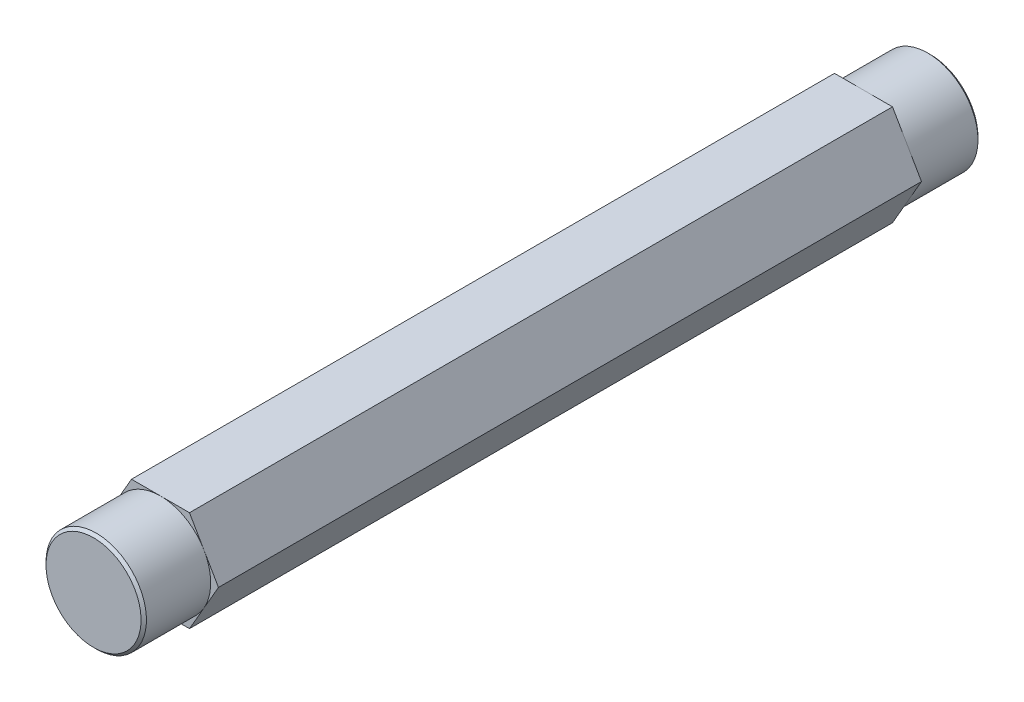
ISO-10303-21;
HEADER;
FILE_DESCRIPTION(('STEP AP214'),'2;1');
FILE_NAME('part.step','',(''),(''),'','','');
FILE_SCHEMA(('AUTOMOTIVE_DESIGN { 1 0 10303 214 1 1 1 1 }'));
ENDSEC;
DATA;
#1=APPLICATION_CONTEXT('core data for automotive mechanical design processes');
#2=APPLICATION_PROTOCOL_DEFINITION('international standard','automotive_design',2000,#1);
#3=PRODUCT_CONTEXT('',#1,'mechanical');
#4=PRODUCT('Part','Part','',(#3));
#5=PRODUCT_RELATED_PRODUCT_CATEGORY('part','',(#4));
#6=PRODUCT_DEFINITION_FORMATION('','',#4);
#7=PRODUCT_DEFINITION_CONTEXT('part definition',#1,'design');
#8=PRODUCT_DEFINITION('design','',#6,#7);
#9=PRODUCT_DEFINITION_SHAPE('','',#8);
#10=(LENGTH_UNIT() NAMED_UNIT(*) SI_UNIT(.MILLI.,.METRE.));
#11=(NAMED_UNIT(*) PLANE_ANGLE_UNIT() SI_UNIT($,.RADIAN.));
#12=(NAMED_UNIT(*) SI_UNIT($,.STERADIAN.) SOLID_ANGLE_UNIT());
#13=UNCERTAINTY_MEASURE_WITH_UNIT(LENGTH_MEASURE(1.E-05),#10,'distance_accuracy_value','');
#14=(GEOMETRIC_REPRESENTATION_CONTEXT(3) GLOBAL_UNCERTAINTY_ASSIGNED_CONTEXT((#13)) GLOBAL_UNIT_ASSIGNED_CONTEXT((#10,
#11,#12)) REPRESENTATION_CONTEXT('',''));
#15=CARTESIAN_POINT('',(0.,0.,0.));
#16=DIRECTION('',(0.,0.,1.));
#17=DIRECTION('',(1.,0.,0.));
#18=AXIS2_PLACEMENT_3D('',#15,#16,#17);
#19=CARTESIAN_POINT('',(0.,0.,73.025));
#20=DIRECTION('',(0.,0.,1.));
#21=DIRECTION('',(1.,0.,0.));
#22=AXIS2_PLACEMENT_3D('',#19,#20,#21);
#23=PLANE('',#22);
#24=CARTESIAN_POINT('',(0.,0.,73.0249999999728));
#25=DIRECTION('',(0.,0.,-1.));
#26=DIRECTION('',(-1.,0.,0.));
#27=AXIS2_PLACEMENT_3D('',#24,#25,#26);
#28=CIRCLE('',#27,4.50849999998582);
#29=CARTESIAN_POINT('',(-4.50849999998582,0.,73.0249999999728));
#30=VERTEX_POINT('',#29);
#31=EDGE_CURVE('E20',#30,#30,#28,.T.);
#32=ORIENTED_EDGE('',*,*,#31,.F.);
#33=EDGE_LOOP('',(#32));
#34=FACE_BOUND('',#33,.T.);
#35=ADVANCED_FACE('F17',(#34),#23,.T.);
#36=CARTESIAN_POINT('',(0.,0.,-6.35));
#37=DIRECTION('',(0.,0.,1.));
#38=DIRECTION('',(1.,0.,0.));
#39=AXIS2_PLACEMENT_3D('',#36,#37,#38);
#40=PLANE('',#39);
#41=CARTESIAN_POINT('',(0.,0.,-6.34999999999764));
#42=DIRECTION('',(0.,0.,1.));
#43=DIRECTION('',(1.,0.,0.));
#44=AXIS2_PLACEMENT_3D('',#41,#42,#43);
#45=CIRCLE('',#44,4.50850000004266);
#46=CARTESIAN_POINT('',(4.50850000004266,0.,-6.34999999999764));
#47=VERTEX_POINT('',#46);
#48=EDGE_CURVE('E179',#47,#47,#45,.T.);
#49=ORIENTED_EDGE('',*,*,#48,.F.);
#50=EDGE_LOOP('',(#49));
#51=FACE_BOUND('',#50,.T.);
#52=ADVANCED_FACE('F520',(#51),#40,.F.);
#53=CARTESIAN_POINT('',(0.,0.,66.675));
#54=DIRECTION('',(0.,0.,1.));
#55=DIRECTION('',(1.,0.,0.));
#56=AXIS2_PLACEMENT_3D('',#53,#54,#55);
#57=PLANE('',#56);
#58=DIRECTION('',(1.,0.,0.));
#59=VECTOR('',#58,1.);
#60=CARTESIAN_POINT('',(2.74963065701558,4.76250000000001,66.675));
#61=LINE('',#60,#59);
#62=CARTESIAN_POINT('',(0.,4.76250000000001,66.675));
#63=VERTEX_POINT('',#62);
#64=CARTESIAN_POINT('',(-2.74963065701562,4.76249999999999,66.675));
#65=VERTEX_POINT('',#64);
#66=EDGE_CURVE('E88',#63,#65,#61,.F.);
#67=ORIENTED_EDGE('',*,*,#66,.T.);
#68=DIRECTION('',(0.499999999999995,0.866025403784441,0.));
#69=VECTOR('',#68,1.);
#70=CARTESIAN_POINT('',(-2.74963065701562,4.76249999999999,66.675));
#71=LINE('',#70,#69);
#72=CARTESIAN_POINT('',(-4.12444598552341,2.38124999999998,66.675));
#73=VERTEX_POINT('',#72);
#74=EDGE_CURVE('E90',#65,#73,#71,.F.);
#75=ORIENTED_EDGE('',*,*,#74,.T.);
#76=CARTESIAN_POINT('',(0.,0.,66.675));
#77=DIRECTION('',(0.,0.,-1.));
#78=DIRECTION('',(-1.,0.,0.));
#79=AXIS2_PLACEMENT_3D('',#76,#77,#78);
#80=CIRCLE('',#79,4.76250000000002);
#81=EDGE_CURVE('E83',#63,#73,#80,.F.);
#82=ORIENTED_EDGE('',*,*,#81,.F.);
#83=EDGE_LOOP('',(#67,#75,#82));
#84=FACE_BOUND('',#83,.T.);
#85=ADVANCED_FACE('F85',(#84),#57,.T.);
#86=CARTESIAN_POINT('',(0.,0.,0.));
#87=DIRECTION('',(0.,0.,1.));
#88=DIRECTION('',(1.,0.,0.));
#89=AXIS2_PLACEMENT_3D('',#86,#87,#88);
#90=PLANE('',#89);
#91=CARTESIAN_POINT('',(0.,0.,0.));
#92=DIRECTION('',(0.,0.,1.));
#93=DIRECTION('',(1.,0.,0.));
#94=AXIS2_PLACEMENT_3D('',#91,#92,#93);
#95=CIRCLE('',#94,4.76250000000002);
#96=CARTESIAN_POINT('',(-4.12444598552342,2.38124999999997,0.));
#97=VERTEX_POINT('',#96);
#98=CARTESIAN_POINT('',(0.,4.76250000000001,0.));
#99=VERTEX_POINT('',#98);
#100=EDGE_CURVE('E176',#97,#99,#95,.F.);
#101=ORIENTED_EDGE('',*,*,#100,.F.);
#102=DIRECTION('',(0.499999999999995,0.866025403784441,0.));
#103=VECTOR('',#102,1.);
#104=CARTESIAN_POINT('',(-2.74963065701562,4.76249999999999,0.));
#105=LINE('',#104,#103);
#106=CARTESIAN_POINT('',(-2.74963065701562,4.76249999999999,0.));
#107=VERTEX_POINT('',#106);
#108=EDGE_CURVE('E134',#97,#107,#105,.T.);
#109=ORIENTED_EDGE('',*,*,#108,.T.);
#110=DIRECTION('',(1.,0.,0.));
#111=VECTOR('',#110,1.);
#112=CARTESIAN_POINT('',(2.74963065701558,4.76250000000001,0.));
#113=LINE('',#112,#111);
#114=EDGE_CURVE('E113',#107,#99,#113,.T.);
#115=ORIENTED_EDGE('',*,*,#114,.T.);
#116=EDGE_LOOP('',(#101,#109,#115));
#117=FACE_BOUND('',#116,.T.);
#118=ADVANCED_FACE('F503',(#117),#90,.F.);
#119=CARTESIAN_POINT('',(0.,0.,72.770999999932));
#120=DIRECTION('',(0.,0.,-1.));
#121=DIRECTION('',(-1.,0.,0.));
#122=AXIS2_PLACEMENT_3D('',#119,#120,#121);
#123=CONICAL_SURFACE('',#122,4.76250000002665,0.785398163397448);
#124=ORIENTED_EDGE('',*,*,#31,.T.);
#125=EDGE_LOOP('',(#124));
#126=FACE_BOUND('',#125,.T.);
#127=CARTESIAN_POINT('',(0.,0.,72.771));
#128=DIRECTION('',(0.,0.,-1.));
#129=DIRECTION('',(-1.,0.,0.));
#130=AXIS2_PLACEMENT_3D('',#127,#128,#129);
#131=CIRCLE('',#130,4.76250000000002);
#132=CARTESIAN_POINT('',(-4.76250000000002,0.,72.771));
#133=VERTEX_POINT('',#132);
#134=EDGE_CURVE('E129',#133,#133,#131,.T.);
#135=ORIENTED_EDGE('',*,*,#134,.F.);
#136=EDGE_LOOP('',(#135));
#137=FACE_BOUND('',#136,.T.);
#138=ADVANCED_FACE('F495',(#126,#137),#123,.T.);
#139=CARTESIAN_POINT('',(0.,0.,66.675));
#140=DIRECTION('',(0.,0.,1.));
#141=DIRECTION('',(1.,0.,0.));
#142=AXIS2_PLACEMENT_3D('',#139,#140,#141);
#143=PLANE('',#142);
#144=DIRECTION('',(0.500000000000001,-0.866025403784438,0.));
#145=VECTOR('',#144,1.);
#146=CARTESIAN_POINT('',(5.49926131403119,0.,66.675));
#147=LINE('',#146,#145);
#148=CARTESIAN_POINT('',(4.1244459855234,2.38125000000001,66.675));
#149=VERTEX_POINT('',#148);
#150=CARTESIAN_POINT('',(2.74963065701558,4.76250000000001,66.675));
#151=VERTEX_POINT('',#150);
#152=EDGE_CURVE('E116',#149,#151,#147,.F.);
#153=ORIENTED_EDGE('',*,*,#152,.T.);
#154=DIRECTION('',(1.,0.,0.));
#155=VECTOR('',#154,1.);
#156=CARTESIAN_POINT('',(2.74963065701558,4.76250000000001,66.675));
#157=LINE('',#156,#155);
#158=EDGE_CURVE('E102',#151,#63,#157,.F.);
#159=ORIENTED_EDGE('',*,*,#158,.T.);
#160=CARTESIAN_POINT('',(0.,0.,66.675));
#161=DIRECTION('',(0.,0.,-1.));
#162=DIRECTION('',(-1.,0.,0.));
#163=AXIS2_PLACEMENT_3D('',#160,#161,#162);
#164=CIRCLE('',#163,4.76250000000002);
#165=EDGE_CURVE('E93',#63,#149,#164,.T.);
#166=ORIENTED_EDGE('',*,*,#165,.T.);
#167=EDGE_LOOP('',(#153,#159,#166));
#168=FACE_BOUND('',#167,.T.);
#169=ADVANCED_FACE('F115',(#168),#143,.T.);
#170=CARTESIAN_POINT('',(2.74963065701558,4.76250000000001,66.675));
#171=DIRECTION('',(0.,-1.,0.));
#172=DIRECTION('',(1.,0.,0.));
#173=AXIS2_PLACEMENT_3D('',#170,#171,#172);
#174=PLANE('',#173);
#175=ORIENTED_EDGE('',*,*,#114,.F.);
#176=DIRECTION('',(0.,0.,1.));
#177=VECTOR('',#176,1.);
#178=CARTESIAN_POINT('',(-2.74963065701562,4.76249999999999,66.675));
#179=LINE('',#178,#177);
#180=EDGE_CURVE('E112',#107,#65,#179,.T.);
#181=ORIENTED_EDGE('',*,*,#180,.T.);
#182=ORIENTED_EDGE('',*,*,#66,.F.);
#183=ORIENTED_EDGE('',*,*,#158,.F.);
#184=DIRECTION('',(0.,0.,1.));
#185=VECTOR('',#184,1.);
#186=CARTESIAN_POINT('',(2.74963065701558,4.76250000000001,66.675));
#187=LINE('',#186,#185);
#188=CARTESIAN_POINT('',(2.74963065701558,4.76250000000001,0.));
#189=VERTEX_POINT('',#188);
#190=EDGE_CURVE('E125',#151,#189,#187,.F.);
#191=ORIENTED_EDGE('',*,*,#190,.T.);
#192=DIRECTION('',(1.,0.,0.));
#193=VECTOR('',#192,1.);
#194=CARTESIAN_POINT('',(0.,4.76250000000001,0.));
#195=LINE('',#194,#193);
#196=EDGE_CURVE('E148',#189,#99,#195,.F.);
#197=ORIENTED_EDGE('',*,*,#196,.T.);
#198=EDGE_LOOP('',(#175,#181,#182,#183,#191,#197));
#199=FACE_BOUND('',#198,.T.);
#200=ADVANCED_FACE('F108',(#199),#174,.F.);
#201=CARTESIAN_POINT('',(0.,0.,0.));
#202=DIRECTION('',(0.,0.,1.));
#203=DIRECTION('',(1.,0.,0.));
#204=AXIS2_PLACEMENT_3D('',#201,#202,#203);
#205=PLANE('',#204);
#206=CARTESIAN_POINT('',(0.,0.,0.));
#207=DIRECTION('',(0.,0.,1.));
#208=DIRECTION('',(1.,0.,0.));
#209=AXIS2_PLACEMENT_3D('',#206,#207,#208);
#210=CIRCLE('',#209,4.76250000000002);
#211=CARTESIAN_POINT('',(4.1244459855234,2.38125000000001,0.));
#212=VERTEX_POINT('',#211);
#213=EDGE_CURVE('E144',#99,#212,#210,.F.);
#214=ORIENTED_EDGE('',*,*,#213,.F.);
#215=ORIENTED_EDGE('',*,*,#196,.F.);
#216=DIRECTION('',(0.500000000000001,-0.866025403784438,0.));
#217=VECTOR('',#216,1.);
#218=CARTESIAN_POINT('',(5.49926131403119,0.,0.));
#219=LINE('',#218,#217);
#220=EDGE_CURVE('E192',#189,#212,#219,.T.);
#221=ORIENTED_EDGE('',*,*,#220,.T.);
#222=EDGE_LOOP('',(#214,#215,#221));
#223=FACE_BOUND('',#222,.T.);
#224=ADVANCED_FACE('F473',(#223),#205,.F.);
#225=CARTESIAN_POINT('',(0.,0.,-6.09600000012733));
#226=DIRECTION('',(0.,0.,1.));
#227=DIRECTION('',(1.,0.,0.));
#228=AXIS2_PLACEMENT_3D('',#225,#226,#227);
#229=CONICAL_SURFACE('',#228,4.76249999991296,0.785398163397448);
#230=ORIENTED_EDGE('',*,*,#48,.T.);
#231=EDGE_LOOP('',(#230));
#232=FACE_BOUND('',#231,.T.);
#233=CARTESIAN_POINT('',(0.,0.,-6.09599999999999));
#234=DIRECTION('',(0.,0.,1.));
#235=DIRECTION('',(1.,0.,0.));
#236=AXIS2_PLACEMENT_3D('',#233,#234,#235);
#237=CIRCLE('',#236,4.76250000000002);
#238=CARTESIAN_POINT('',(4.76250000000002,0.,-6.09599999999999));
#239=VERTEX_POINT('',#238);
#240=EDGE_CURVE('E171',#239,#239,#237,.T.);
#241=ORIENTED_EDGE('',*,*,#240,.F.);
#242=EDGE_LOOP('',(#241));
#243=FACE_BOUND('',#242,.T.);
#244=ADVANCED_FACE('F465',(#232,#243),#229,.T.);
#245=CARTESIAN_POINT('',(-2.74963065701562,4.76249999999999,66.675));
#246=DIRECTION('',(0.866025403784441,-0.499999999999995,0.));
#247=DIRECTION('',(0.499999999999995,0.866025403784441,0.));
#248=AXIS2_PLACEMENT_3D('',#245,#246,#247);
#249=PLANE('',#248);
#250=DIRECTION('',(-0.499999999999989,-0.866025403784445,0.));
#251=VECTOR('',#250,1.);
#252=CARTESIAN_POINT('',(-4.12444598552342,2.38124999999999,0.));
#253=LINE('',#252,#251);
#254=CARTESIAN_POINT('',(-5.49926131403119,0.,0.));
#255=VERTEX_POINT('',#254);
#256=EDGE_CURVE('E133',#97,#255,#253,.T.);
#257=ORIENTED_EDGE('',*,*,#256,.T.);
#258=DIRECTION('',(0.,0.,1.));
#259=VECTOR('',#258,1.);
#260=CARTESIAN_POINT('',(-5.49926131403119,0.,66.675));
#261=LINE('',#260,#259);
#262=CARTESIAN_POINT('',(-5.49926131403119,0.,66.675));
#263=VERTEX_POINT('',#262);
#264=EDGE_CURVE('E168',#255,#263,#261,.T.);
#265=ORIENTED_EDGE('',*,*,#264,.T.);
#266=DIRECTION('',(-0.499999999999995,-0.866025403784442,0.));
#267=VECTOR('',#266,1.);
#268=CARTESIAN_POINT('',(-4.1244459855234,2.38124999999998,66.675));
#269=LINE('',#268,#267);
#270=EDGE_CURVE('E137',#73,#263,#269,.T.);
#271=ORIENTED_EDGE('',*,*,#270,.F.);
#272=ORIENTED_EDGE('',*,*,#74,.F.);
#273=ORIENTED_EDGE('',*,*,#180,.F.);
#274=ORIENTED_EDGE('',*,*,#108,.F.);
#275=EDGE_LOOP('',(#257,#265,#271,#272,#273,#274));
#276=FACE_BOUND('',#275,.T.);
#277=ADVANCED_FACE('F321',(#276),#249,.F.);
#278=CARTESIAN_POINT('',(0.,0.,66.675));
#279=DIRECTION('',(0.,0.,1.));
#280=DIRECTION('',(1.,0.,0.));
#281=AXIS2_PLACEMENT_3D('',#278,#279,#280);
#282=PLANE('',#281);
#283=DIRECTION('',(-0.500000000000007,0.866025403784435,0.));
#284=VECTOR('',#283,1.);
#285=CARTESIAN_POINT('',(-5.49926131403119,0.,66.675));
#286=LINE('',#285,#284);
#287=CARTESIAN_POINT('',(-4.12444598552338,-2.38125000000004,66.675));
#288=VERTEX_POINT('',#287);
#289=EDGE_CURVE('E210',#263,#288,#286,.F.);
#290=ORIENTED_EDGE('',*,*,#289,.T.);
#291=CARTESIAN_POINT('',(0.,0.,66.675));
#292=DIRECTION('',(0.,0.,-1.));
#293=DIRECTION('',(-1.,0.,0.));
#294=AXIS2_PLACEMENT_3D('',#291,#292,#293);
#295=CIRCLE('',#294,4.76250000000002);
#296=EDGE_CURVE('E132',#73,#288,#295,.F.);
#297=ORIENTED_EDGE('',*,*,#296,.F.);
#298=ORIENTED_EDGE('',*,*,#270,.T.);
#299=EDGE_LOOP('',(#290,#297,#298));
#300=FACE_BOUND('',#299,.T.);
#301=ADVANCED_FACE('F318',(#300),#282,.T.);
#302=CARTESIAN_POINT('',(0.,0.,0.));
#303=DIRECTION('',(0.,0.,1.));
#304=DIRECTION('',(1.,0.,0.));
#305=AXIS2_PLACEMENT_3D('',#302,#303,#304);
#306=PLANE('',#305);
#307=ORIENTED_EDGE('',*,*,#256,.F.);
#308=CARTESIAN_POINT('',(0.,0.,0.));
#309=DIRECTION('',(0.,0.,1.));
#310=DIRECTION('',(1.,0.,0.));
#311=AXIS2_PLACEMENT_3D('',#308,#309,#310);
#312=CIRCLE('',#311,4.76250000000002);
#313=CARTESIAN_POINT('',(-4.12444598552337,-2.38125000000006,0.));
#314=VERTEX_POINT('',#313);
#315=EDGE_CURVE('E166',#314,#97,#312,.F.);
#316=ORIENTED_EDGE('',*,*,#315,.F.);
#317=DIRECTION('',(-0.500000000000007,0.866025403784435,0.));
#318=VECTOR('',#317,1.);
#319=CARTESIAN_POINT('',(-5.49926131403119,0.,0.));
#320=LINE('',#319,#318);
#321=EDGE_CURVE('E165',#314,#255,#320,.T.);
#322=ORIENTED_EDGE('',*,*,#321,.T.);
#323=EDGE_LOOP('',(#307,#316,#322));
#324=FACE_BOUND('',#323,.T.);
#325=ADVANCED_FACE('F327',(#324),#306,.F.);
#326=CARTESIAN_POINT('',(0.,0.,73.025));
#327=DIRECTION('',(0.,0.,-1.));
#328=DIRECTION('',(-1.,0.,0.));
#329=AXIS2_PLACEMENT_3D('',#326,#327,#328);
#330=CYLINDRICAL_SURFACE('',#329,4.76250000000002);
#331=ORIENTED_EDGE('',*,*,#134,.T.);
#332=EDGE_LOOP('',(#331));
#333=FACE_BOUND('',#332,.T.);
#334=CARTESIAN_POINT('',(0.,0.,66.675));
#335=DIRECTION('',(0.,0.,-1.));
#336=DIRECTION('',(-1.,0.,0.));
#337=AXIS2_PLACEMENT_3D('',#334,#335,#336);
#338=CIRCLE('',#337,4.76250000000002);
#339=CARTESIAN_POINT('',(4.12444598552342,-2.38124999999998,66.675));
#340=VERTEX_POINT('',#339);
#341=CARTESIAN_POINT('',(0.,-4.76250000000001,66.675));
#342=VERTEX_POINT('',#341);
#343=EDGE_CURVE('E158',#340,#342,#338,.T.);
#344=ORIENTED_EDGE('',*,*,#343,.F.);
#345=CARTESIAN_POINT('',(0.,0.,66.675));
#346=DIRECTION('',(0.,0.,-1.));
#347=DIRECTION('',(-1.,0.,0.));
#348=AXIS2_PLACEMENT_3D('',#345,#346,#347);
#349=CIRCLE('',#348,4.76250000000002);
#350=EDGE_CURVE('E97',#149,#340,#349,.T.);
#351=ORIENTED_EDGE('',*,*,#350,.F.);
#352=ORIENTED_EDGE('',*,*,#165,.F.);
#353=ORIENTED_EDGE('',*,*,#81,.T.);
#354=ORIENTED_EDGE('',*,*,#296,.T.);
#355=CARTESIAN_POINT('',(0.,0.,66.675));
#356=DIRECTION('',(0.,0.,-1.));
#357=DIRECTION('',(-1.,0.,0.));
#358=AXIS2_PLACEMENT_3D('',#355,#356,#357);
#359=CIRCLE('',#358,4.76250000000002);
#360=EDGE_CURVE('E162',#342,#288,#359,.T.);
#361=ORIENTED_EDGE('',*,*,#360,.F.);
#362=EDGE_LOOP('',(#344,#351,#352,#353,#354,#361));
#363=FACE_BOUND('',#362,.T.);
#364=ADVANCED_FACE('F96',(#333,#363),#330,.T.);
#365=CARTESIAN_POINT('',(0.,0.,66.675));
#366=DIRECTION('',(0.,0.,1.));
#367=DIRECTION('',(1.,0.,0.));
#368=AXIS2_PLACEMENT_3D('',#365,#366,#367);
#369=PLANE('',#368);
#370=DIRECTION('',(0.500000000000001,-0.866025403784438,0.));
#371=VECTOR('',#370,1.);
#372=CARTESIAN_POINT('',(5.49926131403119,0.,66.675));
#373=LINE('',#372,#371);
#374=CARTESIAN_POINT('',(5.49926131403119,0.,66.675));
#375=VERTEX_POINT('',#374);
#376=EDGE_CURVE('E126',#375,#149,#373,.F.);
#377=ORIENTED_EDGE('',*,*,#376,.T.);
#378=ORIENTED_EDGE('',*,*,#350,.T.);
#379=DIRECTION('',(-0.499999999999995,-0.866025403784442,0.));
#380=VECTOR('',#379,1.);
#381=CARTESIAN_POINT('',(2.74963065701565,-4.76249999999997,66.675));
#382=LINE('',#381,#380);
#383=EDGE_CURVE('E221',#340,#375,#382,.F.);
#384=ORIENTED_EDGE('',*,*,#383,.T.);
#385=EDGE_LOOP('',(#377,#378,#384));
#386=FACE_BOUND('',#385,.T.);
#387=ADVANCED_FACE('F339',(#386),#369,.T.);
#388=CARTESIAN_POINT('',(5.49926131403119,0.,66.675));
#389=DIRECTION('',(-0.866025403784438,-0.500000000000001,0.));
#390=DIRECTION('',(0.500000000000001,-0.866025403784438,0.));
#391=AXIS2_PLACEMENT_3D('',#388,#389,#390);
#392=PLANE('',#391);
#393=ORIENTED_EDGE('',*,*,#220,.F.);
#394=ORIENTED_EDGE('',*,*,#190,.F.);
#395=ORIENTED_EDGE('',*,*,#152,.F.);
#396=ORIENTED_EDGE('',*,*,#376,.F.);
#397=DIRECTION('',(0.,0.,1.));
#398=VECTOR('',#397,1.);
#399=CARTESIAN_POINT('',(5.49926131403119,0.,66.675));
#400=LINE('',#399,#398);
#401=CARTESIAN_POINT('',(5.49926131403119,0.,0.));
#402=VERTEX_POINT('',#401);
#403=EDGE_CURVE('E224',#375,#402,#400,.F.);
#404=ORIENTED_EDGE('',*,*,#403,.T.);
#405=DIRECTION('',(-0.500000000000001,0.866025403784438,0.));
#406=VECTOR('',#405,1.);
#407=CARTESIAN_POINT('',(5.49926131403119,0.,0.));
#408=LINE('',#407,#406);
#409=EDGE_CURVE('E194',#402,#212,#408,.T.);
#410=ORIENTED_EDGE('',*,*,#409,.T.);
#411=EDGE_LOOP('',(#393,#394,#395,#396,#404,#410));
#412=FACE_BOUND('',#411,.T.);
#413=ADVANCED_FACE('F335',(#412),#392,.F.);
#414=CARTESIAN_POINT('',(0.,0.,0.));
#415=DIRECTION('',(0.,0.,1.));
#416=DIRECTION('',(1.,0.,0.));
#417=AXIS2_PLACEMENT_3D('',#414,#415,#416);
#418=PLANE('',#417);
#419=CARTESIAN_POINT('',(0.,0.,0.));
#420=DIRECTION('',(0.,0.,1.));
#421=DIRECTION('',(1.,0.,0.));
#422=AXIS2_PLACEMENT_3D('',#419,#420,#421);
#423=CIRCLE('',#422,4.76250000000002);
#424=CARTESIAN_POINT('',(4.12444598552342,-2.38124999999999,0.));
#425=VERTEX_POINT('',#424);
#426=EDGE_CURVE('E169',#212,#425,#423,.F.);
#427=ORIENTED_EDGE('',*,*,#426,.F.);
#428=ORIENTED_EDGE('',*,*,#409,.F.);
#429=DIRECTION('',(-0.499999999999995,-0.866025403784442,0.));
#430=VECTOR('',#429,1.);
#431=CARTESIAN_POINT('',(2.74963065701565,-4.76249999999997,0.));
#432=LINE('',#431,#430);
#433=EDGE_CURVE('E233',#402,#425,#432,.T.);
#434=ORIENTED_EDGE('',*,*,#433,.T.);
#435=EDGE_LOOP('',(#427,#428,#434));
#436=FACE_BOUND('',#435,.T.);
#437=ADVANCED_FACE('F332',(#436),#418,.F.);
#438=CARTESIAN_POINT('',(0.,0.,-6.35));
#439=DIRECTION('',(0.,0.,1.));
#440=DIRECTION('',(1.,0.,0.));
#441=AXIS2_PLACEMENT_3D('',#438,#439,#440);
#442=CYLINDRICAL_SURFACE('',#441,4.76250000000002);
#443=ORIENTED_EDGE('',*,*,#240,.T.);
#444=EDGE_LOOP('',(#443));
#445=FACE_BOUND('',#444,.T.);
#446=CARTESIAN_POINT('',(0.,0.,0.));
#447=DIRECTION('',(0.,0.,1.));
#448=DIRECTION('',(1.,0.,0.));
#449=AXIS2_PLACEMENT_3D('',#446,#447,#448);
#450=CIRCLE('',#449,4.76250000000002);
#451=CARTESIAN_POINT('',(0.,-4.76250000000001,0.));
#452=VERTEX_POINT('',#451);
#453=EDGE_CURVE('E34',#452,#314,#450,.F.);
#454=ORIENTED_EDGE('',*,*,#453,.T.);
#455=ORIENTED_EDGE('',*,*,#315,.T.);
#456=ORIENTED_EDGE('',*,*,#100,.T.);
#457=ORIENTED_EDGE('',*,*,#213,.T.);
#458=ORIENTED_EDGE('',*,*,#426,.T.);
#459=CARTESIAN_POINT('',(0.,0.,0.));
#460=DIRECTION('',(0.,0.,1.));
#461=DIRECTION('',(1.,0.,0.));
#462=AXIS2_PLACEMENT_3D('',#459,#460,#461);
#463=CIRCLE('',#462,4.76250000000002);
#464=EDGE_CURVE('E155',#425,#452,#463,.F.);
#465=ORIENTED_EDGE('',*,*,#464,.T.);
#466=EDGE_LOOP('',(#454,#455,#456,#457,#458,#465));
#467=FACE_BOUND('',#466,.T.);
#468=ADVANCED_FACE('F329',(#445,#467),#442,.T.);
#469=CARTESIAN_POINT('',(-5.49926131403119,0.,66.675));
#470=DIRECTION('',(0.866025403784435,0.500000000000007,0.));
#471=DIRECTION('',(-0.500000000000007,0.866025403784435,0.));
#472=AXIS2_PLACEMENT_3D('',#469,#470,#471);
#473=PLANE('',#472);
#474=DIRECTION('',(0.500000000000014,-0.866025403784431,0.));
#475=VECTOR('',#474,1.);
#476=CARTESIAN_POINT('',(-4.12444598552339,-2.38125000000004,0.));
#477=LINE('',#476,#475);
#478=CARTESIAN_POINT('',(-2.74963065701555,-4.76250000000003,0.));
#479=VERTEX_POINT('',#478);
#480=EDGE_CURVE('E154',#314,#479,#477,.T.);
#481=ORIENTED_EDGE('',*,*,#480,.T.);
#482=DIRECTION('',(0.,0.,1.));
#483=VECTOR('',#482,1.);
#484=CARTESIAN_POINT('',(-2.74963065701555,-4.76250000000003,66.675));
#485=LINE('',#484,#483);
#486=CARTESIAN_POINT('',(-2.74963065701555,-4.76250000000003,66.675));
#487=VERTEX_POINT('',#486);
#488=EDGE_CURVE('E254',#479,#487,#485,.T.);
#489=ORIENTED_EDGE('',*,*,#488,.T.);
#490=DIRECTION('',(0.500000000000007,-0.866025403784434,0.));
#491=VECTOR('',#490,1.);
#492=CARTESIAN_POINT('',(-4.12444598552337,-2.38125000000003,66.675));
#493=LINE('',#492,#491);
#494=EDGE_CURVE('E161',#288,#487,#493,.T.);
#495=ORIENTED_EDGE('',*,*,#494,.F.);
#496=ORIENTED_EDGE('',*,*,#289,.F.);
#497=ORIENTED_EDGE('',*,*,#264,.F.);
#498=ORIENTED_EDGE('',*,*,#321,.F.);
#499=EDGE_LOOP('',(#481,#489,#495,#496,#497,#498));
#500=FACE_BOUND('',#499,.T.);
#501=ADVANCED_FACE('F286',(#500),#473,.F.);
#502=CARTESIAN_POINT('',(0.,0.,66.675));
#503=DIRECTION('',(0.,0.,1.));
#504=DIRECTION('',(1.,0.,0.));
#505=AXIS2_PLACEMENT_3D('',#502,#503,#504);
#506=PLANE('',#505);
#507=ORIENTED_EDGE('',*,*,#494,.T.);
#508=DIRECTION('',(-1.,0.,0.));
#509=VECTOR('',#508,1.);
#510=CARTESIAN_POINT('',(-2.74963065701555,-4.76250000000003,66.675));
#511=LINE('',#510,#509);
#512=EDGE_CURVE('E250',#487,#342,#511,.F.);
#513=ORIENTED_EDGE('',*,*,#512,.T.);
#514=ORIENTED_EDGE('',*,*,#360,.T.);
#515=EDGE_LOOP('',(#507,#513,#514));
#516=FACE_BOUND('',#515,.T.);
#517=ADVANCED_FACE('F315',(#516),#506,.T.);
#518=CARTESIAN_POINT('',(0.,0.,66.675));
#519=DIRECTION('',(0.,0.,1.));
#520=DIRECTION('',(1.,0.,0.));
#521=AXIS2_PLACEMENT_3D('',#518,#519,#520);
#522=PLANE('',#521);
#523=DIRECTION('',(-1.,0.,0.));
#524=VECTOR('',#523,1.);
#525=CARTESIAN_POINT('',(-2.74963065701555,-4.76250000000003,66.675));
#526=LINE('',#525,#524);
#527=CARTESIAN_POINT('',(2.74963065701565,-4.76249999999997,66.675));
#528=VERTEX_POINT('',#527);
#529=EDGE_CURVE('E253',#342,#528,#526,.F.);
#530=ORIENTED_EDGE('',*,*,#529,.T.);
#531=DIRECTION('',(-0.499999999999995,-0.866025403784442,0.));
#532=VECTOR('',#531,1.);
#533=CARTESIAN_POINT('',(2.74963065701565,-4.76249999999997,66.675));
#534=LINE('',#533,#532);
#535=EDGE_CURVE('E160',#528,#340,#534,.F.);
#536=ORIENTED_EDGE('',*,*,#535,.T.);
#537=ORIENTED_EDGE('',*,*,#343,.T.);
#538=EDGE_LOOP('',(#530,#536,#537));
#539=FACE_BOUND('',#538,.T.);
#540=ADVANCED_FACE('F311',(#539),#522,.T.);
#541=CARTESIAN_POINT('',(2.74963065701565,-4.76249999999997,66.675));
#542=DIRECTION('',(-0.866025403784442,0.499999999999995,0.));
#543=DIRECTION('',(-0.499999999999995,-0.866025403784442,0.));
#544=AXIS2_PLACEMENT_3D('',#541,#542,#543);
#545=PLANE('',#544);
#546=ORIENTED_EDGE('',*,*,#433,.F.);
#547=ORIENTED_EDGE('',*,*,#403,.F.);
#548=ORIENTED_EDGE('',*,*,#383,.F.);
#549=ORIENTED_EDGE('',*,*,#535,.F.);
#550=DIRECTION('',(0.,0.,1.));
#551=VECTOR('',#550,1.);
#552=CARTESIAN_POINT('',(2.74963065701565,-4.76249999999997,66.675));
#553=LINE('',#552,#551);
#554=CARTESIAN_POINT('',(2.74963065701564,-4.76249999999999,0.));
#555=VERTEX_POINT('',#554);
#556=EDGE_CURVE('E259',#528,#555,#553,.F.);
#557=ORIENTED_EDGE('',*,*,#556,.T.);
#558=DIRECTION('',(0.499999999999995,0.866025403784441,0.));
#559=VECTOR('',#558,1.);
#560=CARTESIAN_POINT('',(2.74963065701565,-4.76249999999997,0.));
#561=LINE('',#560,#559);
#562=EDGE_CURVE('E157',#555,#425,#561,.T.);
#563=ORIENTED_EDGE('',*,*,#562,.T.);
#564=EDGE_LOOP('',(#546,#547,#548,#549,#557,#563));
#565=FACE_BOUND('',#564,.T.);
#566=ADVANCED_FACE('F304',(#565),#545,.F.);
#567=CARTESIAN_POINT('',(0.,0.,0.));
#568=DIRECTION('',(0.,0.,1.));
#569=DIRECTION('',(1.,0.,0.));
#570=AXIS2_PLACEMENT_3D('',#567,#568,#569);
#571=PLANE('',#570);
#572=ORIENTED_EDGE('',*,*,#464,.F.);
#573=ORIENTED_EDGE('',*,*,#562,.F.);
#574=DIRECTION('',(-1.,0.,0.));
#575=VECTOR('',#574,1.);
#576=CARTESIAN_POINT('',(-2.74963065701555,-4.76250000000003,0.));
#577=LINE('',#576,#575);
#578=EDGE_CURVE('E26',#555,#452,#577,.T.);
#579=ORIENTED_EDGE('',*,*,#578,.T.);
#580=EDGE_LOOP('',(#572,#573,#579));
#581=FACE_BOUND('',#580,.T.);
#582=ADVANCED_FACE('F301',(#581),#571,.F.);
#583=CARTESIAN_POINT('',(0.,0.,0.));
#584=DIRECTION('',(0.,0.,1.));
#585=DIRECTION('',(1.,0.,0.));
#586=AXIS2_PLACEMENT_3D('',#583,#584,#585);
#587=PLANE('',#586);
#588=ORIENTED_EDGE('',*,*,#453,.F.);
#589=DIRECTION('',(-1.,0.,0.));
#590=VECTOR('',#589,1.);
#591=CARTESIAN_POINT('',(-2.74963065701555,-4.76250000000003,0.));
#592=LINE('',#591,#590);
#593=EDGE_CURVE('E11',#452,#479,#592,.T.);
#594=ORIENTED_EDGE('',*,*,#593,.T.);
#595=ORIENTED_EDGE('',*,*,#480,.F.);
#596=EDGE_LOOP('',(#588,#594,#595));
#597=FACE_BOUND('',#596,.T.);
#598=ADVANCED_FACE('F293',(#597),#587,.F.);
#599=CARTESIAN_POINT('',(-2.74963065701555,-4.76250000000003,66.675));
#600=DIRECTION('',(0.,1.,0.));
#601=DIRECTION('',(-1.,0.,0.));
#602=AXIS2_PLACEMENT_3D('',#599,#600,#601);
#603=PLANE('',#602);
#604=ORIENTED_EDGE('',*,*,#578,.F.);
#605=ORIENTED_EDGE('',*,*,#556,.F.);
#606=ORIENTED_EDGE('',*,*,#529,.F.);
#607=ORIENTED_EDGE('',*,*,#512,.F.);
#608=ORIENTED_EDGE('',*,*,#488,.F.);
#609=ORIENTED_EDGE('',*,*,#593,.F.);
#610=EDGE_LOOP('',(#604,#605,#606,#607,#608,#609));
#611=FACE_BOUND('',#610,.T.);
#612=ADVANCED_FACE('F296',(#611),#603,.F.);
#613=CLOSED_SHELL('',(#35,#52,#85,#118,#138,#169,#200,#224,#244,#277,#301,#325,#364,#387,#413,
#437,#468,#501,#517,#540,#566,#582,#598,#612));
#614=MANIFOLD_SOLID_BREP('B1',#613);
#615=ADVANCED_BREP_SHAPE_REPRESENTATION('',(#18,#614),#14);
#616=SHAPE_DEFINITION_REPRESENTATION(#9,#615);
ENDSEC;
END-ISO-10303-21;
